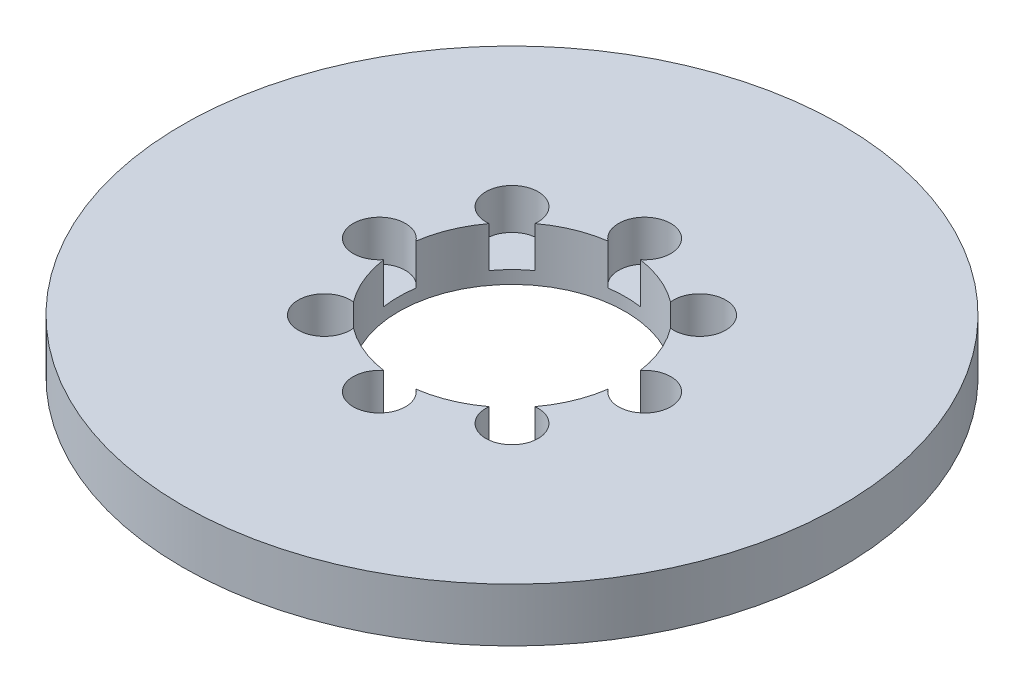
ISO-10303-21;
HEADER;
FILE_DESCRIPTION(('STEP AP214'),'2;1');
FILE_NAME('part.step','',(''),(''),'','','');
FILE_SCHEMA(('AUTOMOTIVE_DESIGN { 1 0 10303 214 1 1 1 1 }'));
ENDSEC;
DATA;
#1=APPLICATION_CONTEXT('core data for automotive mechanical design processes');
#2=APPLICATION_PROTOCOL_DEFINITION('international standard','automotive_design',2000,#1);
#3=PRODUCT_CONTEXT('',#1,'mechanical');
#4=PRODUCT('Part','Part','',(#3));
#5=PRODUCT_RELATED_PRODUCT_CATEGORY('part','',(#4));
#6=PRODUCT_DEFINITION_FORMATION('','',#4);
#7=PRODUCT_DEFINITION_CONTEXT('part definition',#1,'design');
#8=PRODUCT_DEFINITION('design','',#6,#7);
#9=PRODUCT_DEFINITION_SHAPE('','',#8);
#10=(LENGTH_UNIT() NAMED_UNIT(*) SI_UNIT(.MILLI.,.METRE.));
#11=(NAMED_UNIT(*) PLANE_ANGLE_UNIT() SI_UNIT($,.RADIAN.));
#12=(NAMED_UNIT(*) SI_UNIT($,.STERADIAN.) SOLID_ANGLE_UNIT());
#13=UNCERTAINTY_MEASURE_WITH_UNIT(LENGTH_MEASURE(1.E-05),#10,'distance_accuracy_value','');
#14=(GEOMETRIC_REPRESENTATION_CONTEXT(3) GLOBAL_UNCERTAINTY_ASSIGNED_CONTEXT((#13)) GLOBAL_UNIT_ASSIGNED_CONTEXT((#10,
#11,#12)) REPRESENTATION_CONTEXT('',''));
#15=CARTESIAN_POINT('',(0.,0.,0.));
#16=DIRECTION('',(0.,0.,1.));
#17=DIRECTION('',(1.,0.,0.));
#18=AXIS2_PLACEMENT_3D('',#15,#16,#17);
#19=CARTESIAN_POINT('',(0.,13.,0.));
#20=DIRECTION('',(0.,-1.,0.));
#21=DIRECTION('',(0.,0.,-1.));
#22=AXIS2_PLACEMENT_3D('',#19,#20,#21);
#23=CYLINDRICAL_SURFACE('',#22,80.);
#24=CARTESIAN_POINT('',(0.,13.,0.));
#25=DIRECTION('',(0.,1.,0.));
#26=DIRECTION('',(0.,0.,1.));
#27=AXIS2_PLACEMENT_3D('',#24,#25,#26);
#28=CIRCLE('',#27,80.);
#29=CARTESIAN_POINT('',(0.,13.,-80.));
#30=VERTEX_POINT('',#29);
#31=EDGE_CURVE('E195',#30,#30,#28,.T.);
#32=CARTESIAN_POINT('',(0.,0.,0.));
#33=DIRECTION('',(0.,1.,0.));
#34=DIRECTION('',(0.,0.,1.));
#35=AXIS2_PLACEMENT_3D('',#32,#33,#34);
#36=CIRCLE('',#35,80.);
#37=CARTESIAN_POINT('',(0.,0.,-80.));
#38=VERTEX_POINT('',#37);
#39=EDGE_CURVE('E179',#38,#38,#36,.T.);
#40=CARTESIAN_POINT('',(0.,13.,-80.));
#41=CARTESIAN_POINT('',(0.,12.8645833333333,-80.));
#42=CARTESIAN_POINT('',(0.,12.7291666666667,-80.));
#43=CARTESIAN_POINT('',(0.,12.4583333333333,-80.));
#44=CARTESIAN_POINT('',(0.,12.3229166666667,-80.));
#45=CARTESIAN_POINT('',(0.,12.0520833333333,-80.));
#46=CARTESIAN_POINT('',(0.,11.9166666666667,-80.));
#47=CARTESIAN_POINT('',(0.,11.6458333333333,-80.));
#48=CARTESIAN_POINT('',(0.,11.5104166666667,-80.));
#49=CARTESIAN_POINT('',(0.,11.2395833333333,-80.));
#50=CARTESIAN_POINT('',(0.,11.1041666666667,-80.));
#51=CARTESIAN_POINT('',(0.,10.8333333333333,-80.));
#52=CARTESIAN_POINT('',(0.,10.6979166666667,-80.));
#53=CARTESIAN_POINT('',(0.,10.4270833333333,-80.));
#54=CARTESIAN_POINT('',(0.,10.2916666666667,-80.));
#55=CARTESIAN_POINT('',(0.,10.0208333333333,-80.));
#56=CARTESIAN_POINT('',(0.,9.88541666666667,-80.));
#57=CARTESIAN_POINT('',(0.,9.61458333333333,-80.));
#58=CARTESIAN_POINT('',(0.,9.47916666666667,-80.));
#59=CARTESIAN_POINT('',(0.,9.20833333333333,-80.));
#60=CARTESIAN_POINT('',(0.,9.07291666666667,-80.));
#61=CARTESIAN_POINT('',(0.,8.80208333333333,-80.));
#62=CARTESIAN_POINT('',(0.,8.66666666666667,-80.));
#63=CARTESIAN_POINT('',(0.,8.39583333333333,-80.));
#64=CARTESIAN_POINT('',(0.,8.26041666666667,-80.));
#65=CARTESIAN_POINT('',(0.,7.98958333333333,-80.));
#66=CARTESIAN_POINT('',(0.,7.85416666666667,-80.));
#67=CARTESIAN_POINT('',(0.,7.58333333333333,-80.));
#68=CARTESIAN_POINT('',(0.,7.44791666666667,-80.));
#69=CARTESIAN_POINT('',(0.,7.17708333333333,-80.));
#70=CARTESIAN_POINT('',(0.,7.04166666666667,-80.));
#71=CARTESIAN_POINT('',(0.,6.77083333333333,-80.));
#72=CARTESIAN_POINT('',(0.,6.63541666666667,-80.));
#73=CARTESIAN_POINT('',(0.,6.36458333333333,-80.));
#74=CARTESIAN_POINT('',(0.,6.22916666666667,-80.));
#75=CARTESIAN_POINT('',(0.,5.95833333333333,-80.));
#76=CARTESIAN_POINT('',(0.,5.82291666666667,-80.));
#77=CARTESIAN_POINT('',(0.,5.55208333333333,-80.));
#78=CARTESIAN_POINT('',(0.,5.41666666666667,-80.));
#79=CARTESIAN_POINT('',(0.,5.14583333333333,-80.));
#80=CARTESIAN_POINT('',(0.,5.01041666666667,-80.));
#81=CARTESIAN_POINT('',(0.,4.73958333333333,-80.));
#82=CARTESIAN_POINT('',(0.,4.60416666666667,-80.));
#83=CARTESIAN_POINT('',(0.,4.33333333333333,-80.));
#84=CARTESIAN_POINT('',(0.,4.19791666666667,-80.));
#85=CARTESIAN_POINT('',(0.,3.92708333333333,-80.));
#86=CARTESIAN_POINT('',(0.,3.79166666666667,-80.));
#87=CARTESIAN_POINT('',(0.,3.52083333333333,-80.));
#88=CARTESIAN_POINT('',(0.,3.38541666666667,-80.));
#89=CARTESIAN_POINT('',(0.,3.11458333333333,-80.));
#90=CARTESIAN_POINT('',(0.,2.97916666666667,-80.));
#91=CARTESIAN_POINT('',(0.,2.70833333333333,-80.));
#92=CARTESIAN_POINT('',(0.,2.57291666666667,-80.));
#93=CARTESIAN_POINT('',(0.,2.30208333333333,-80.));
#94=CARTESIAN_POINT('',(0.,2.16666666666667,-80.));
#95=CARTESIAN_POINT('',(0.,1.89583333333333,-80.));
#96=CARTESIAN_POINT('',(0.,1.76041666666667,-80.));
#97=CARTESIAN_POINT('',(0.,1.48958333333333,-80.));
#98=CARTESIAN_POINT('',(0.,1.35416666666667,-80.));
#99=CARTESIAN_POINT('',(0.,1.08333333333333,-80.));
#100=CARTESIAN_POINT('',(0.,0.947916666666667,-80.));
#101=CARTESIAN_POINT('',(0.,0.677083333333334,-80.));
#102=CARTESIAN_POINT('',(0.,0.541666666666667,-80.));
#103=CARTESIAN_POINT('',(0.,0.270833333333334,-80.));
#104=CARTESIAN_POINT('',(0.,0.135416666666667,-80.));
#105=CARTESIAN_POINT('',(0.,0.,-80.));
#106=B_SPLINE_CURVE_WITH_KNOTS('',3,(#40,#41,#42,#43,#44,#45,#46,#47,#48,#49,#50,#51,#52,#53,
#54,#55,#56,#57,#58,#59,#60,#61,#62,#63,#64,#65,#66,#67,#68,#69,#70,#71,#72,#73,#74,#75,#76,#77,
#78,#79,#80,#81,#82,#83,#84,#85,#86,#87,#88,#89,#90,#91,#92,#93,#94,#95,#96,#97,#98,#99,#100,
#101,#102,#103,#104,#105),.UNSPECIFIED.,.F.,.F.,(4,2,2,2,2,2,2,2,2,2,2,2,2,2,2,2,2,2,2,2,2,2,2,
2,2,2,2,2,2,2,2,2,4),(0.,0.406249999999999,0.812499999999999,1.21875,1.625,2.03125,2.4375,
2.84375,3.25,3.65625,4.0625,4.46875,4.875,5.28125,5.6875,6.09375,6.5,6.90625,7.3125,7.71875,
8.125,8.53125,8.9375,9.34375,9.75,10.15625,10.5625,10.96875,11.375,11.78125,12.1875,12.59375,
13.),.UNSPECIFIED.);
#107=EDGE_CURVE('BSEAM39',#30,#38,#106,.T.);
#108=ORIENTED_EDGE('',*,*,#31,.F.);
#109=ORIENTED_EDGE('',*,*,#39,.T.);
#110=ORIENTED_EDGE('',*,*,#107,.T.);
#111=ORIENTED_EDGE('',*,*,#107,.F.);
#112=EDGE_LOOP('',(#108,#110,#109,#111));
#113=FACE_BOUND('',#112,.T.);
#114=ADVANCED_FACE('F39',(#113),#23,.T.);
#115=CARTESIAN_POINT('',(0.,13.,0.));
#116=DIRECTION('',(0.,1.,0.));
#117=DIRECTION('',(0.,0.,1.));
#118=AXIS2_PLACEMENT_3D('',#115,#116,#117);
#119=PLANE('',#118);
#120=CARTESIAN_POINT('',(1.12440242981259E-13,13.,32.2041655300712));
#121=DIRECTION('',(0.,1.,0.));
#122=DIRECTION('',(1.,0.,0.));
#123=AXIS2_PLACEMENT_3D('',#120,#121,#122);
#124=CIRCLE('',#123,6.3449020200599);
#125=CARTESIAN_POINT('',(-3.92444679516898,13.,27.2185362823185));
#126=VERTEX_POINT('',#125);
#127=CARTESIAN_POINT('',(3.92444679516917,13.,27.2185362823185));
#128=VERTEX_POINT('',#127);
#129=EDGE_CURVE('E176',#126,#128,#124,.T.);
#130=ORIENTED_EDGE('',*,*,#129,.F.);
#131=CARTESIAN_POINT('',(0.,13.,0.));
#132=DIRECTION('',(0.,1.,0.));
#133=DIRECTION('',(0.,0.,1.));
#134=AXIS2_PLACEMENT_3D('',#131,#132,#133);
#135=CIRCLE('',#134,27.5);
#136=CARTESIAN_POINT('',(-16.4714086379296,13.,22.0214145204694));
#137=VERTEX_POINT('',#136);
#138=EDGE_CURVE('E166',#137,#126,#135,.T.);
#139=ORIENTED_EDGE('',*,*,#138,.F.);
#140=CARTESIAN_POINT('',(-22.7717838287674,13.,22.7717838287675));
#141=DIRECTION('',(0.,1.,0.));
#142=DIRECTION('',(0.707106781186549,0.,0.707106781186546));
#143=AXIS2_PLACEMENT_3D('',#140,#141,#142);
#144=CIRCLE('',#143,6.3449020200599);
#145=CARTESIAN_POINT('',(-22.0214145204693,13.,16.4714086379296));
#146=VERTEX_POINT('',#145);
#147=EDGE_CURVE('E147',#146,#137,#144,.T.);
#148=ORIENTED_EDGE('',*,*,#147,.F.);
#149=CARTESIAN_POINT('',(-27.2185362823185,13.,3.92444679516908));
#150=VERTEX_POINT('',#149);
#151=EDGE_CURVE('E180',#150,#146,#135,.T.);
#152=ORIENTED_EDGE('',*,*,#151,.F.);
#153=CARTESIAN_POINT('',(-32.2041655300712,13.,0.));
#154=DIRECTION('',(0.,1.,0.));
#155=DIRECTION('',(0.,0.,1.));
#156=AXIS2_PLACEMENT_3D('',#153,#154,#155);
#157=CIRCLE('',#156,6.3449020200599);
#158=CARTESIAN_POINT('',(-27.2185362823185,13.,-3.92444679516908));
#159=VERTEX_POINT('',#158);
#160=EDGE_CURVE('E186',#159,#150,#157,.T.);
#161=ORIENTED_EDGE('',*,*,#160,.F.);
#162=CARTESIAN_POINT('',(-22.0214145204695,13.,-16.4714086379293));
#163=VERTEX_POINT('',#162);
#164=EDGE_CURVE('E182',#163,#159,#135,.T.);
#165=ORIENTED_EDGE('',*,*,#164,.F.);
#166=CARTESIAN_POINT('',(-22.7717838287677,13.,-22.7717838287671));
#167=DIRECTION('',(0.,1.,0.));
#168=DIRECTION('',(-0.707106781186539,0.,0.707106781186556));
#169=AXIS2_PLACEMENT_3D('',#166,#167,#168);
#170=CIRCLE('',#169,6.3449020200599);
#171=CARTESIAN_POINT('',(-16.4714086379299,13.,-22.0214145204691));
#172=VERTEX_POINT('',#171);
#173=EDGE_CURVE('E446',#172,#163,#170,.T.);
#174=ORIENTED_EDGE('',*,*,#173,.F.);
#175=CARTESIAN_POINT('',(-3.92444679516936,13.,-27.2185362823184));
#176=VERTEX_POINT('',#175);
#177=EDGE_CURVE('E452',#176,#172,#135,.T.);
#178=ORIENTED_EDGE('',*,*,#177,.F.);
#179=CARTESIAN_POINT('',(-3.37320728943777E-13,13.,-32.2041655300712));
#180=DIRECTION('',(0.,1.,0.));
#181=DIRECTION('',(-1.,0.,0.));
#182=AXIS2_PLACEMENT_3D('',#179,#180,#181);
#183=CIRCLE('',#182,6.3449020200599);
#184=CARTESIAN_POINT('',(3.92444679516879,13.,-27.2185362823185));
#185=VERTEX_POINT('',#184);
#186=EDGE_CURVE('E477',#185,#176,#183,.T.);
#187=ORIENTED_EDGE('',*,*,#186,.F.);
#188=CARTESIAN_POINT('',(16.4714086379294,13.,-22.0214145204695));
#189=VERTEX_POINT('',#188);
#190=EDGE_CURVE('E460',#189,#185,#135,.T.);
#191=ORIENTED_EDGE('',*,*,#190,.F.);
#192=CARTESIAN_POINT('',(22.7717838287672,13.,-22.7717838287676));
#193=DIRECTION('',(0.,1.,0.));
#194=DIRECTION('',(-0.707106781186554,0.,-0.707106781186541));
#195=AXIS2_PLACEMENT_3D('',#192,#193,#194);
#196=CIRCLE('',#195,6.3449020200599);
#197=CARTESIAN_POINT('',(22.0214145204692,13.,-16.4714086379298));
#198=VERTEX_POINT('',#197);
#199=EDGE_CURVE('E464',#198,#189,#196,.T.);
#200=ORIENTED_EDGE('',*,*,#199,.F.);
#201=CARTESIAN_POINT('',(27.2185362823185,13.,-3.92444679516908));
#202=VERTEX_POINT('',#201);
#203=EDGE_CURVE('E459',#202,#198,#135,.T.);
#204=ORIENTED_EDGE('',*,*,#203,.F.);
#205=CARTESIAN_POINT('',(32.2041655300712,13.,0.));
#206=DIRECTION('',(0.,1.,0.));
#207=DIRECTION('',(0.,0.,-1.));
#208=AXIS2_PLACEMENT_3D('',#205,#206,#207);
#209=CIRCLE('',#208,6.3449020200599);
#210=CARTESIAN_POINT('',(27.2185362823185,13.,3.92444679516908));
#211=VERTEX_POINT('',#210);
#212=EDGE_CURVE('E469',#211,#202,#209,.T.);
#213=ORIENTED_EDGE('',*,*,#212,.F.);
#214=CARTESIAN_POINT('',(22.0214145204694,13.,16.4714086379295));
#215=VERTEX_POINT('',#214);
#216=EDGE_CURVE('E181',#215,#211,#135,.T.);
#217=ORIENTED_EDGE('',*,*,#216,.F.);
#218=CARTESIAN_POINT('',(22.7717838287675,13.,22.7717838287673));
#219=DIRECTION('',(0.,1.,0.));
#220=DIRECTION('',(0.707106781186544,0.,-0.707106781186551));
#221=AXIS2_PLACEMENT_3D('',#218,#219,#220);
#222=CIRCLE('',#221,6.3449020200599);
#223=CARTESIAN_POINT('',(16.4714086379297,13.,22.0214145204693));
#224=VERTEX_POINT('',#223);
#225=EDGE_CURVE('E475',#224,#215,#222,.T.);
#226=ORIENTED_EDGE('',*,*,#225,.F.);
#227=EDGE_CURVE('E177',#128,#224,#135,.T.);
#228=ORIENTED_EDGE('',*,*,#227,.F.);
#229=EDGE_LOOP('',(#130,#139,#148,#152,#161,#165,#174,#178,#187,#191,#200,#204,#213,#217,#226,#228));
#230=FACE_BOUND('',#229,.T.);
#231=ORIENTED_EDGE('',*,*,#31,.T.);
#232=EDGE_LOOP('',(#231));
#233=FACE_BOUND('',#232,.T.);
#234=ADVANCED_FACE('F172',(#230,#233),#119,.T.);
#235=CARTESIAN_POINT('',(0.,0.,0.));
#236=DIRECTION('',(0.,1.,0.));
#237=DIRECTION('',(0.,0.,1.));
#238=AXIS2_PLACEMENT_3D('',#235,#236,#237);
#239=PLANE('',#238);
#240=CARTESIAN_POINT('',(0.,0.,0.));
#241=DIRECTION('',(0.,1.,0.));
#242=DIRECTION('',(0.,0.,1.));
#243=AXIS2_PLACEMENT_3D('',#240,#241,#242);
#244=CIRCLE('',#243,27.5);
#245=CARTESIAN_POINT('',(0.,0.,27.5));
#246=VERTEX_POINT('',#245);
#247=EDGE_CURVE('E187',#246,#246,#244,.T.);
#248=ORIENTED_EDGE('',*,*,#247,.T.);
#249=EDGE_LOOP('',(#248));
#250=FACE_BOUND('',#249,.T.);
#251=ORIENTED_EDGE('',*,*,#39,.F.);
#252=EDGE_LOOP('',(#251));
#253=FACE_BOUND('',#252,.T.);
#254=ADVANCED_FACE('F270',(#250,#253),#239,.F.);
#255=CARTESIAN_POINT('',(0.,13.,0.));
#256=DIRECTION('',(0.,-1.,0.));
#257=DIRECTION('',(0.,0.,-1.));
#258=AXIS2_PLACEMENT_3D('',#255,#256,#257);
#259=CYLINDRICAL_SURFACE('',#258,27.5);
#260=DIRECTION('',(0.,1.,0.));
#261=VECTOR('',#260,1.);
#262=CARTESIAN_POINT('',(-3.92444679516897,8.06130323771885,27.2185362823185));
#263=LINE('',#262,#261);
#264=CARTESIAN_POINT('',(-3.92444679516898,3.12260647543771,27.2185362823185));
#265=VERTEX_POINT('',#264);
#266=EDGE_CURVE('E11',#265,#126,#263,.T.);
#267=ORIENTED_EDGE('',*,*,#266,.F.);
#268=CARTESIAN_POINT('',(0.,3.12260647543771,0.));
#269=DIRECTION('',(0.,1.,0.));
#270=DIRECTION('',(0.,0.,1.));
#271=AXIS2_PLACEMENT_3D('',#268,#269,#270);
#272=CIRCLE('',#271,27.5);
#273=CARTESIAN_POINT('',(3.92444679516917,3.12260647543771,27.2185362823185));
#274=VERTEX_POINT('',#273);
#275=EDGE_CURVE('E250',#265,#274,#272,.T.);
#276=ORIENTED_EDGE('',*,*,#275,.T.);
#277=DIRECTION('',(0.,1.,0.));
#278=VECTOR('',#277,1.);
#279=CARTESIAN_POINT('',(3.92444679516916,8.06130323771885,27.2185362823184));
#280=LINE('',#279,#278);
#281=EDGE_CURVE('E46',#128,#274,#280,.F.);
#282=ORIENTED_EDGE('',*,*,#281,.F.);
#283=ORIENTED_EDGE('',*,*,#227,.T.);
#284=DIRECTION('',(0.,1.,0.));
#285=VECTOR('',#284,1.);
#286=CARTESIAN_POINT('',(16.4714086379297,8.06130323771885,22.0214145204692));
#287=LINE('',#286,#285);
#288=CARTESIAN_POINT('',(16.4714086379297,3.12260647543771,22.0214145204693));
#289=VERTEX_POINT('',#288);
#290=EDGE_CURVE('E244',#289,#224,#287,.T.);
#291=ORIENTED_EDGE('',*,*,#290,.F.);
#292=CARTESIAN_POINT('',(0.,3.12260647543771,0.));
#293=DIRECTION('',(0.,1.,0.));
#294=DIRECTION('',(0.,0.,1.));
#295=AXIS2_PLACEMENT_3D('',#292,#293,#294);
#296=CIRCLE('',#295,27.5);
#297=CARTESIAN_POINT('',(22.0214145204694,3.12260647543771,16.4714086379295));
#298=VERTEX_POINT('',#297);
#299=EDGE_CURVE('E238',#289,#298,#296,.T.);
#300=ORIENTED_EDGE('',*,*,#299,.T.);
#301=DIRECTION('',(0.,1.,0.));
#302=VECTOR('',#301,1.);
#303=CARTESIAN_POINT('',(22.0214145204694,8.06130323771885,16.4714086379295));
#304=LINE('',#303,#302);
#305=EDGE_CURVE('E242',#215,#298,#304,.F.);
#306=ORIENTED_EDGE('',*,*,#305,.F.);
#307=ORIENTED_EDGE('',*,*,#216,.T.);
#308=DIRECTION('',(0.,1.,0.));
#309=VECTOR('',#308,1.);
#310=CARTESIAN_POINT('',(27.2185362823185,8.06130323771885,3.92444679516906));
#311=LINE('',#310,#309);
#312=CARTESIAN_POINT('',(27.2185362823185,3.12260647543771,3.92444679516908));
#313=VERTEX_POINT('',#312);
#314=EDGE_CURVE('E236',#313,#211,#311,.T.);
#315=ORIENTED_EDGE('',*,*,#314,.F.);
#316=CARTESIAN_POINT('',(0.,3.12260647543771,0.));
#317=DIRECTION('',(0.,1.,0.));
#318=DIRECTION('',(0.,0.,1.));
#319=AXIS2_PLACEMENT_3D('',#316,#317,#318);
#320=CIRCLE('',#319,27.5);
#321=CARTESIAN_POINT('',(27.2185362823185,3.12260647543771,-3.92444679516908));
#322=VERTEX_POINT('',#321);
#323=EDGE_CURVE('E235',#313,#322,#320,.T.);
#324=ORIENTED_EDGE('',*,*,#323,.T.);
#325=DIRECTION('',(0.,1.,0.));
#326=VECTOR('',#325,1.);
#327=CARTESIAN_POINT('',(27.2185362823185,8.06130323771885,-3.92444679516906));
#328=LINE('',#327,#326);
#329=EDGE_CURVE('E234',#202,#322,#328,.F.);
#330=ORIENTED_EDGE('',*,*,#329,.F.);
#331=ORIENTED_EDGE('',*,*,#203,.T.);
#332=DIRECTION('',(0.,1.,0.));
#333=VECTOR('',#332,1.);
#334=CARTESIAN_POINT('',(22.0214145204692,8.06130323771885,-16.4714086379298));
#335=LINE('',#334,#333);
#336=CARTESIAN_POINT('',(22.0214145204692,3.12260647543771,-16.4714086379298));
#337=VERTEX_POINT('',#336);
#338=EDGE_CURVE('E229',#337,#198,#335,.T.);
#339=ORIENTED_EDGE('',*,*,#338,.F.);
#340=CARTESIAN_POINT('',(0.,3.12260647543771,0.));
#341=DIRECTION('',(0.,1.,0.));
#342=DIRECTION('',(0.,0.,1.));
#343=AXIS2_PLACEMENT_3D('',#340,#341,#342);
#344=CIRCLE('',#343,27.5);
#345=CARTESIAN_POINT('',(16.4714086379294,3.12260647543771,-22.0214145204695));
#346=VERTEX_POINT('',#345);
#347=EDGE_CURVE('E221',#337,#346,#344,.T.);
#348=ORIENTED_EDGE('',*,*,#347,.T.);
#349=DIRECTION('',(0.,1.,0.));
#350=VECTOR('',#349,1.);
#351=CARTESIAN_POINT('',(16.4714086379294,8.06130323771885,-22.0214145204695));
#352=LINE('',#351,#350);
#353=EDGE_CURVE('E230',#189,#346,#352,.F.);
#354=ORIENTED_EDGE('',*,*,#353,.F.);
#355=ORIENTED_EDGE('',*,*,#190,.T.);
#356=DIRECTION('',(0.,1.,0.));
#357=VECTOR('',#356,1.);
#358=CARTESIAN_POINT('',(3.92444679516878,8.06130323771885,-27.2185362823185));
#359=LINE('',#358,#357);
#360=CARTESIAN_POINT('',(3.92444679516879,3.12260647543771,-27.2185362823185));
#361=VERTEX_POINT('',#360);
#362=EDGE_CURVE('E225',#361,#185,#359,.T.);
#363=ORIENTED_EDGE('',*,*,#362,.F.);
#364=CARTESIAN_POINT('',(0.,3.12260647543771,0.));
#365=DIRECTION('',(0.,1.,0.));
#366=DIRECTION('',(0.,0.,1.));
#367=AXIS2_PLACEMENT_3D('',#364,#365,#366);
#368=CIRCLE('',#367,27.5);
#369=CARTESIAN_POINT('',(-3.92444679516936,3.12260647543771,-27.2185362823184));
#370=VERTEX_POINT('',#369);
#371=EDGE_CURVE('E216',#361,#370,#368,.T.);
#372=ORIENTED_EDGE('',*,*,#371,.T.);
#373=DIRECTION('',(0.,1.,0.));
#374=VECTOR('',#373,1.);
#375=CARTESIAN_POINT('',(-3.92444679516935,8.06130323771885,-27.2185362823184));
#376=LINE('',#375,#374);
#377=EDGE_CURVE('E218',#176,#370,#376,.F.);
#378=ORIENTED_EDGE('',*,*,#377,.F.);
#379=ORIENTED_EDGE('',*,*,#177,.T.);
#380=DIRECTION('',(0.,1.,0.));
#381=VECTOR('',#380,1.);
#382=CARTESIAN_POINT('',(-16.4714086379299,8.06130323771885,-22.0214145204691));
#383=LINE('',#382,#381);
#384=CARTESIAN_POINT('',(-16.4714086379299,3.12260647543771,-22.0214145204691));
#385=VERTEX_POINT('',#384);
#386=EDGE_CURVE('E212',#385,#172,#383,.T.);
#387=ORIENTED_EDGE('',*,*,#386,.F.);
#388=CARTESIAN_POINT('',(0.,3.12260647543771,0.));
#389=DIRECTION('',(0.,1.,0.));
#390=DIRECTION('',(0.,0.,1.));
#391=AXIS2_PLACEMENT_3D('',#388,#389,#390);
#392=CIRCLE('',#391,27.5);
#393=CARTESIAN_POINT('',(-22.0214145204695,3.12260647543771,-16.4714086379293));
#394=VERTEX_POINT('',#393);
#395=EDGE_CURVE('E208',#385,#394,#392,.T.);
#396=ORIENTED_EDGE('',*,*,#395,.T.);
#397=DIRECTION('',(0.,1.,0.));
#398=VECTOR('',#397,1.);
#399=CARTESIAN_POINT('',(-22.0214145204695,8.06130323771885,-16.4714086379293));
#400=LINE('',#399,#398);
#401=EDGE_CURVE('E211',#163,#394,#400,.F.);
#402=ORIENTED_EDGE('',*,*,#401,.F.);
#403=ORIENTED_EDGE('',*,*,#164,.T.);
#404=DIRECTION('',(0.,1.,0.));
#405=VECTOR('',#404,1.);
#406=CARTESIAN_POINT('',(-27.2185362823185,8.06130323771885,-3.92444679516906));
#407=LINE('',#406,#405);
#408=CARTESIAN_POINT('',(-27.2185362823185,3.12260647543771,-3.92444679516908));
#409=VERTEX_POINT('',#408);
#410=EDGE_CURVE('E201',#409,#159,#407,.T.);
#411=ORIENTED_EDGE('',*,*,#410,.F.);
#412=CARTESIAN_POINT('',(0.,3.12260647543771,0.));
#413=DIRECTION('',(0.,1.,0.));
#414=DIRECTION('',(0.,0.,1.));
#415=AXIS2_PLACEMENT_3D('',#412,#413,#414);
#416=CIRCLE('',#415,27.5);
#417=CARTESIAN_POINT('',(-27.2185362823185,3.12260647543771,3.92444679516908));
#418=VERTEX_POINT('',#417);
#419=EDGE_CURVE('E194',#409,#418,#416,.T.);
#420=ORIENTED_EDGE('',*,*,#419,.T.);
#421=DIRECTION('',(0.,1.,0.));
#422=VECTOR('',#421,1.);
#423=CARTESIAN_POINT('',(-27.2185362823185,8.06130323771885,3.92444679516906));
#424=LINE('',#423,#422);
#425=EDGE_CURVE('E199',#150,#418,#424,.F.);
#426=ORIENTED_EDGE('',*,*,#425,.F.);
#427=ORIENTED_EDGE('',*,*,#151,.T.);
#428=DIRECTION('',(0.,1.,0.));
#429=VECTOR('',#428,1.);
#430=CARTESIAN_POINT('',(-22.0214145204693,8.06130323771885,16.4714086379296));
#431=LINE('',#430,#429);
#432=CARTESIAN_POINT('',(-22.0214145204693,3.12260647543771,16.4714086379296));
#433=VERTEX_POINT('',#432);
#434=EDGE_CURVE('E160',#433,#146,#431,.T.);
#435=ORIENTED_EDGE('',*,*,#434,.F.);
#436=CARTESIAN_POINT('',(0.,3.12260647543771,0.));
#437=DIRECTION('',(0.,1.,0.));
#438=DIRECTION('',(0.,0.,1.));
#439=AXIS2_PLACEMENT_3D('',#436,#437,#438);
#440=CIRCLE('',#439,27.5);
#441=CARTESIAN_POINT('',(-16.4714086379296,3.12260647543771,22.0214145204694));
#442=VERTEX_POINT('',#441);
#443=EDGE_CURVE('E168',#433,#442,#440,.T.);
#444=ORIENTED_EDGE('',*,*,#443,.T.);
#445=DIRECTION('',(0.,1.,0.));
#446=VECTOR('',#445,1.);
#447=CARTESIAN_POINT('',(-16.4714086379296,8.06130323771885,22.0214145204694));
#448=LINE('',#447,#446);
#449=EDGE_CURVE('E152',#137,#442,#448,.F.);
#450=ORIENTED_EDGE('',*,*,#449,.F.);
#451=ORIENTED_EDGE('',*,*,#138,.T.);
#452=EDGE_LOOP('',(#267,#276,#282,#283,#291,#300,#306,#307,#315,#324,#330,#331,#339,#348,#354,
#355,#363,#372,#378,#379,#387,#396,#402,#403,#411,#420,#426,#427,#435,#444,#450,#451));
#453=FACE_BOUND('',#452,.T.);
#454=ORIENTED_EDGE('',*,*,#247,.F.);
#455=EDGE_LOOP('',(#454));
#456=FACE_BOUND('',#455,.T.);
#457=ADVANCED_FACE('F170',(#453,#456),#259,.F.);
#458=CARTESIAN_POINT('',(-32.2041655300712,3.12260647543771,0.));
#459=DIRECTION('',(0.,1.,0.));
#460=DIRECTION('',(0.,0.,1.));
#461=AXIS2_PLACEMENT_3D('',#458,#459,#460);
#462=CYLINDRICAL_SURFACE('',#461,6.3449020200599);
#463=ORIENTED_EDGE('',*,*,#410,.T.);
#464=ORIENTED_EDGE('',*,*,#160,.T.);
#465=ORIENTED_EDGE('',*,*,#425,.T.);
#466=CARTESIAN_POINT('',(-32.2041655300712,3.12260647543771,0.));
#467=DIRECTION('',(0.,1.,0.));
#468=DIRECTION('',(0.,0.,1.));
#469=AXIS2_PLACEMENT_3D('',#466,#467,#468);
#470=CIRCLE('',#469,6.3449020200599);
#471=EDGE_CURVE('E191',#409,#418,#470,.T.);
#472=ORIENTED_EDGE('',*,*,#471,.F.);
#473=EDGE_LOOP('',(#463,#464,#465,#472));
#474=FACE_BOUND('',#473,.T.);
#475=ADVANCED_FACE('F279',(#474),#462,.F.);
#476=CARTESIAN_POINT('',(-32.2041655300712,3.12260647543771,0.));
#477=DIRECTION('',(0.,1.,0.));
#478=DIRECTION('',(0.,0.,1.));
#479=AXIS2_PLACEMENT_3D('',#476,#477,#478);
#480=PLANE('',#479);
#481=ORIENTED_EDGE('',*,*,#471,.T.);
#482=ORIENTED_EDGE('',*,*,#419,.F.);
#483=EDGE_LOOP('',(#481,#482));
#484=FACE_BOUND('',#483,.T.);
#485=ADVANCED_FACE('F285',(#484),#480,.T.);
#486=CARTESIAN_POINT('',(-22.7717838287674,3.12260647543771,22.7717838287675));
#487=DIRECTION('',(0.,1.,0.));
#488=DIRECTION('',(0.,0.,1.));
#489=AXIS2_PLACEMENT_3D('',#486,#487,#488);
#490=CYLINDRICAL_SURFACE('',#489,6.3449020200599);
#491=ORIENTED_EDGE('',*,*,#434,.T.);
#492=ORIENTED_EDGE('',*,*,#147,.T.);
#493=ORIENTED_EDGE('',*,*,#449,.T.);
#494=CARTESIAN_POINT('',(-22.7717838287674,3.12260647543771,22.7717838287675));
#495=DIRECTION('',(0.,1.,0.));
#496=DIRECTION('',(0.707106781186549,0.,0.707106781186546));
#497=AXIS2_PLACEMENT_3D('',#494,#495,#496);
#498=CIRCLE('',#497,6.3449020200599);
#499=EDGE_CURVE('E165',#433,#442,#498,.T.);
#500=ORIENTED_EDGE('',*,*,#499,.F.);
#501=EDGE_LOOP('',(#491,#492,#493,#500));
#502=FACE_BOUND('',#501,.T.);
#503=ADVANCED_FACE('F155',(#502),#490,.F.);
#504=CARTESIAN_POINT('',(-22.7717838287674,3.12260647543771,22.7717838287675));
#505=DIRECTION('',(0.,1.,0.));
#506=DIRECTION('',(0.707106781186549,0.,0.707106781186546));
#507=AXIS2_PLACEMENT_3D('',#504,#505,#506);
#508=PLANE('',#507);
#509=ORIENTED_EDGE('',*,*,#499,.T.);
#510=ORIENTED_EDGE('',*,*,#443,.F.);
#511=EDGE_LOOP('',(#509,#510));
#512=FACE_BOUND('',#511,.T.);
#513=ADVANCED_FACE('F288',(#512),#508,.T.);
#514=CARTESIAN_POINT('',(-22.7717838287677,3.12260647543771,-22.7717838287671));
#515=DIRECTION('',(0.,1.,0.));
#516=DIRECTION('',(0.,0.,1.));
#517=AXIS2_PLACEMENT_3D('',#514,#515,#516);
#518=CYLINDRICAL_SURFACE('',#517,6.3449020200599);
#519=ORIENTED_EDGE('',*,*,#386,.T.);
#520=ORIENTED_EDGE('',*,*,#173,.T.);
#521=ORIENTED_EDGE('',*,*,#401,.T.);
#522=CARTESIAN_POINT('',(-22.7717838287677,3.12260647543771,-22.7717838287671));
#523=DIRECTION('',(0.,1.,0.));
#524=DIRECTION('',(-0.707106781186539,0.,0.707106781186556));
#525=AXIS2_PLACEMENT_3D('',#522,#523,#524);
#526=CIRCLE('',#525,6.3449020200599);
#527=EDGE_CURVE('E447',#385,#394,#526,.T.);
#528=ORIENTED_EDGE('',*,*,#527,.F.);
#529=EDGE_LOOP('',(#519,#520,#521,#528));
#530=FACE_BOUND('',#529,.T.);
#531=ADVANCED_FACE('F295',(#530),#518,.F.);
#532=CARTESIAN_POINT('',(-22.7717838287677,3.12260647543771,-22.7717838287671));
#533=DIRECTION('',(0.,1.,0.));
#534=DIRECTION('',(-0.707106781186539,0.,0.707106781186556));
#535=AXIS2_PLACEMENT_3D('',#532,#533,#534);
#536=PLANE('',#535);
#537=ORIENTED_EDGE('',*,*,#527,.T.);
#538=ORIENTED_EDGE('',*,*,#395,.F.);
#539=EDGE_LOOP('',(#537,#538));
#540=FACE_BOUND('',#539,.T.);
#541=ADVANCED_FACE('F375',(#540),#536,.T.);
#542=CARTESIAN_POINT('',(-3.37320728943777E-13,3.12260647543771,-32.2041655300712));
#543=DIRECTION('',(0.,1.,0.));
#544=DIRECTION('',(0.,0.,1.));
#545=AXIS2_PLACEMENT_3D('',#542,#543,#544);
#546=CYLINDRICAL_SURFACE('',#545,6.3449020200599);
#547=ORIENTED_EDGE('',*,*,#362,.T.);
#548=ORIENTED_EDGE('',*,*,#186,.T.);
#549=ORIENTED_EDGE('',*,*,#377,.T.);
#550=CARTESIAN_POINT('',(-3.37320728943777E-13,3.12260647543771,-32.2041655300712));
#551=DIRECTION('',(0.,1.,0.));
#552=DIRECTION('',(-1.,0.,0.));
#553=AXIS2_PLACEMENT_3D('',#550,#551,#552);
#554=CIRCLE('',#553,6.3449020200599);
#555=EDGE_CURVE('E467',#361,#370,#554,.T.);
#556=ORIENTED_EDGE('',*,*,#555,.F.);
#557=EDGE_LOOP('',(#547,#548,#549,#556));
#558=FACE_BOUND('',#557,.T.);
#559=ADVANCED_FACE('F361',(#558),#546,.F.);
#560=CARTESIAN_POINT('',(-3.37320728943777E-13,3.12260647543771,-32.2041655300712));
#561=DIRECTION('',(0.,1.,0.));
#562=DIRECTION('',(-1.,0.,0.));
#563=AXIS2_PLACEMENT_3D('',#560,#561,#562);
#564=PLANE('',#563);
#565=ORIENTED_EDGE('',*,*,#555,.T.);
#566=ORIENTED_EDGE('',*,*,#371,.F.);
#567=EDGE_LOOP('',(#565,#566));
#568=FACE_BOUND('',#567,.T.);
#569=ADVANCED_FACE('F297',(#568),#564,.T.);
#570=CARTESIAN_POINT('',(22.7717838287672,3.12260647543771,-22.7717838287676));
#571=DIRECTION('',(0.,1.,0.));
#572=DIRECTION('',(0.,0.,1.));
#573=AXIS2_PLACEMENT_3D('',#570,#571,#572);
#574=CYLINDRICAL_SURFACE('',#573,6.3449020200599);
#575=ORIENTED_EDGE('',*,*,#338,.T.);
#576=ORIENTED_EDGE('',*,*,#199,.T.);
#577=ORIENTED_EDGE('',*,*,#353,.T.);
#578=CARTESIAN_POINT('',(22.7717838287672,3.12260647543771,-22.7717838287676));
#579=DIRECTION('',(0.,1.,0.));
#580=DIRECTION('',(-0.707106781186554,0.,-0.707106781186541));
#581=AXIS2_PLACEMENT_3D('',#578,#579,#580);
#582=CIRCLE('',#581,6.3449020200599);
#583=EDGE_CURVE('E470',#337,#346,#582,.T.);
#584=ORIENTED_EDGE('',*,*,#583,.F.);
#585=EDGE_LOOP('',(#575,#576,#577,#584));
#586=FACE_BOUND('',#585,.T.);
#587=ADVANCED_FACE('F294',(#586),#574,.F.);
#588=CARTESIAN_POINT('',(22.7717838287672,3.12260647543771,-22.7717838287676));
#589=DIRECTION('',(0.,1.,0.));
#590=DIRECTION('',(-0.707106781186554,0.,-0.707106781186541));
#591=AXIS2_PLACEMENT_3D('',#588,#589,#590);
#592=PLANE('',#591);
#593=ORIENTED_EDGE('',*,*,#583,.T.);
#594=ORIENTED_EDGE('',*,*,#347,.F.);
#595=EDGE_LOOP('',(#593,#594));
#596=FACE_BOUND('',#595,.T.);
#597=ADVANCED_FACE('F300',(#596),#592,.T.);
#598=CARTESIAN_POINT('',(32.2041655300712,3.12260647543771,0.));
#599=DIRECTION('',(0.,1.,0.));
#600=DIRECTION('',(0.,0.,1.));
#601=AXIS2_PLACEMENT_3D('',#598,#599,#600);
#602=CYLINDRICAL_SURFACE('',#601,6.3449020200599);
#603=ORIENTED_EDGE('',*,*,#314,.T.);
#604=ORIENTED_EDGE('',*,*,#212,.T.);
#605=ORIENTED_EDGE('',*,*,#329,.T.);
#606=CARTESIAN_POINT('',(32.2041655300712,3.12260647543771,0.));
#607=DIRECTION('',(0.,1.,0.));
#608=DIRECTION('',(0.,0.,-1.));
#609=AXIS2_PLACEMENT_3D('',#606,#607,#608);
#610=CIRCLE('',#609,6.3449020200599);
#611=EDGE_CURVE('E472',#313,#322,#610,.T.);
#612=ORIENTED_EDGE('',*,*,#611,.F.);
#613=EDGE_LOOP('',(#603,#604,#605,#612));
#614=FACE_BOUND('',#613,.T.);
#615=ADVANCED_FACE('F305',(#614),#602,.F.);
#616=CARTESIAN_POINT('',(32.2041655300712,3.12260647543771,0.));
#617=DIRECTION('',(0.,1.,0.));
#618=DIRECTION('',(0.,0.,-1.));
#619=AXIS2_PLACEMENT_3D('',#616,#617,#618);
#620=PLANE('',#619);
#621=ORIENTED_EDGE('',*,*,#611,.T.);
#622=ORIENTED_EDGE('',*,*,#323,.F.);
#623=EDGE_LOOP('',(#621,#622));
#624=FACE_BOUND('',#623,.T.);
#625=ADVANCED_FACE('F308',(#624),#620,.T.);
#626=CARTESIAN_POINT('',(22.7717838287675,3.12260647543771,22.7717838287673));
#627=DIRECTION('',(0.,1.,0.));
#628=DIRECTION('',(0.,0.,1.));
#629=AXIS2_PLACEMENT_3D('',#626,#627,#628);
#630=CYLINDRICAL_SURFACE('',#629,6.3449020200599);
#631=ORIENTED_EDGE('',*,*,#290,.T.);
#632=ORIENTED_EDGE('',*,*,#225,.T.);
#633=ORIENTED_EDGE('',*,*,#305,.T.);
#634=CARTESIAN_POINT('',(22.7717838287675,3.12260647543771,22.7717838287673));
#635=DIRECTION('',(0.,1.,0.));
#636=DIRECTION('',(0.707106781186544,0.,-0.707106781186551));
#637=AXIS2_PLACEMENT_3D('',#634,#635,#636);
#638=CIRCLE('',#637,6.3449020200599);
#639=EDGE_CURVE('E56',#289,#298,#638,.T.);
#640=ORIENTED_EDGE('',*,*,#639,.F.);
#641=EDGE_LOOP('',(#631,#632,#633,#640));
#642=FACE_BOUND('',#641,.T.);
#643=ADVANCED_FACE('F309',(#642),#630,.F.);
#644=CARTESIAN_POINT('',(22.7717838287675,3.12260647543771,22.7717838287673));
#645=DIRECTION('',(0.,1.,0.));
#646=DIRECTION('',(0.707106781186544,0.,-0.707106781186551));
#647=AXIS2_PLACEMENT_3D('',#644,#645,#646);
#648=PLANE('',#647);
#649=ORIENTED_EDGE('',*,*,#639,.T.);
#650=ORIENTED_EDGE('',*,*,#299,.F.);
#651=EDGE_LOOP('',(#649,#650));
#652=FACE_BOUND('',#651,.T.);
#653=ADVANCED_FACE('F256',(#652),#648,.T.);
#654=CARTESIAN_POINT('',(1.12440242981259E-13,3.12260647543771,32.2041655300712));
#655=DIRECTION('',(0.,1.,0.));
#656=DIRECTION('',(0.,0.,1.));
#657=AXIS2_PLACEMENT_3D('',#654,#655,#656);
#658=CYLINDRICAL_SURFACE('',#657,6.3449020200599);
#659=ORIENTED_EDGE('',*,*,#266,.T.);
#660=ORIENTED_EDGE('',*,*,#129,.T.);
#661=ORIENTED_EDGE('',*,*,#281,.T.);
#662=CARTESIAN_POINT('',(1.12440242981259E-13,3.12260647543771,32.2041655300712));
#663=DIRECTION('',(0.,1.,0.));
#664=DIRECTION('',(1.,0.,0.));
#665=AXIS2_PLACEMENT_3D('',#662,#663,#664);
#666=CIRCLE('',#665,6.3449020200599);
#667=EDGE_CURVE('E55',#265,#274,#666,.T.);
#668=ORIENTED_EDGE('',*,*,#667,.F.);
#669=EDGE_LOOP('',(#659,#660,#661,#668));
#670=FACE_BOUND('',#669,.T.);
#671=ADVANCED_FACE('F253',(#670),#658,.F.);
#672=CARTESIAN_POINT('',(1.12440242981259E-13,3.12260647543771,32.2041655300712));
#673=DIRECTION('',(0.,1.,0.));
#674=DIRECTION('',(1.,0.,0.));
#675=AXIS2_PLACEMENT_3D('',#672,#673,#674);
#676=PLANE('',#675);
#677=ORIENTED_EDGE('',*,*,#667,.T.);
#678=ORIENTED_EDGE('',*,*,#275,.F.);
#679=EDGE_LOOP('',(#677,#678));
#680=FACE_BOUND('',#679,.T.);
#681=ADVANCED_FACE('F252',(#680),#676,.T.);
#682=CLOSED_SHELL('',(#114,#234,#254,#457,#475,#485,#503,#513,#531,#541,#559,#569,#587,#597,
#615,#625,#643,#653,#671,#681));
#683=MANIFOLD_SOLID_BREP('B2',#682);
#684=ADVANCED_BREP_SHAPE_REPRESENTATION('',(#18,#683),#14);
#685=SHAPE_DEFINITION_REPRESENTATION(#9,#684);
ENDSEC;
END-ISO-10303-21;
